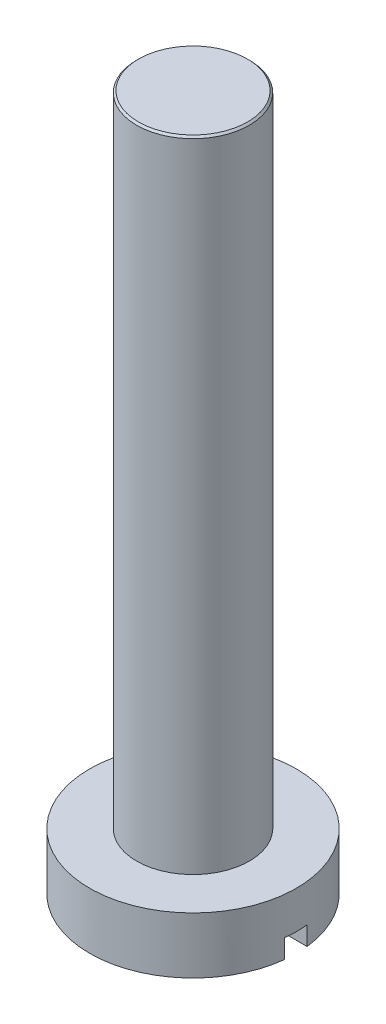
ISO-10303-21;
HEADER;
FILE_DESCRIPTION(('STEP AP214'),'2;1');
FILE_NAME('part.step','',(''),(''),'','','');
FILE_SCHEMA(('AUTOMOTIVE_DESIGN { 1 0 10303 214 1 1 1 1 }'));
ENDSEC;
DATA;
#1=APPLICATION_CONTEXT('core data for automotive mechanical design processes');
#2=APPLICATION_PROTOCOL_DEFINITION('international standard','automotive_design',2000,#1);
#3=PRODUCT_CONTEXT('',#1,'mechanical');
#4=PRODUCT('Part','Part','',(#3));
#5=PRODUCT_RELATED_PRODUCT_CATEGORY('part','',(#4));
#6=PRODUCT_DEFINITION_FORMATION('','',#4);
#7=PRODUCT_DEFINITION_CONTEXT('part definition',#1,'design');
#8=PRODUCT_DEFINITION('design','',#6,#7);
#9=PRODUCT_DEFINITION_SHAPE('','',#8);
#10=(LENGTH_UNIT() NAMED_UNIT(*) SI_UNIT(.MILLI.,.METRE.));
#11=(NAMED_UNIT(*) PLANE_ANGLE_UNIT() SI_UNIT($,.RADIAN.));
#12=(NAMED_UNIT(*) SI_UNIT($,.STERADIAN.) SOLID_ANGLE_UNIT());
#13=UNCERTAINTY_MEASURE_WITH_UNIT(LENGTH_MEASURE(1.E-05),#10,'distance_accuracy_value','');
#14=(GEOMETRIC_REPRESENTATION_CONTEXT(3) GLOBAL_UNCERTAINTY_ASSIGNED_CONTEXT((#13)) GLOBAL_UNIT_ASSIGNED_CONTEXT((#10,
#11,#12)) REPRESENTATION_CONTEXT('',''));
#15=CARTESIAN_POINT('',(0.,0.,0.));
#16=DIRECTION('',(0.,0.,1.));
#17=DIRECTION('',(1.,0.,0.));
#18=AXIS2_PLACEMENT_3D('',#15,#16,#17);
#19=CARTESIAN_POINT('',(0.,-1.5,0.));
#20=DIRECTION('',(0.,-1.,0.));
#21=DIRECTION('',(0.,0.,-1.));
#22=AXIS2_PLACEMENT_3D('',#19,#20,#21);
#23=PLANE('',#22);
#24=DIRECTION('',(1.,0.,0.));
#25=VECTOR('',#24,1.);
#26=CARTESIAN_POINT('',(0.,-1.5,-0.3));
#27=LINE('',#26,#25);
#28=CARTESIAN_POINT('',(-2.73358738656733,-1.5,-0.3));
#29=VERTEX_POINT('',#28);
#30=CARTESIAN_POINT('',(2.73358738656733,-1.5,-0.3));
#31=VERTEX_POINT('',#30);
#32=EDGE_CURVE('E99',#29,#31,#27,.T.);
#33=ORIENTED_EDGE('',*,*,#32,.F.);
#34=CARTESIAN_POINT('',(0.,-1.5,0.));
#35=DIRECTION('',(0.,-1.,0.));
#36=DIRECTION('',(0.,0.,-1.));
#37=AXIS2_PLACEMENT_3D('',#34,#35,#36);
#38=CIRCLE('',#37,2.75);
#39=EDGE_CURVE('E109',#29,#31,#38,.T.);
#40=ORIENTED_EDGE('',*,*,#39,.T.);
#41=EDGE_LOOP('',(#33,#40));
#42=FACE_BOUND('',#41,.T.);
#43=ADVANCED_FACE('F51',(#42),#23,.T.);
#44=CARTESIAN_POINT('',(0.,-1.5,0.));
#45=DIRECTION('',(0.,1.,0.));
#46=DIRECTION('',(0.,0.,1.));
#47=AXIS2_PLACEMENT_3D('',#44,#45,#46);
#48=CYLINDRICAL_SURFACE('',#47,2.75);
#49=CARTESIAN_POINT('',(0.,-1.,0.));
#50=DIRECTION('',(0.,1.,0.));
#51=DIRECTION('',(0.,0.,1.));
#52=AXIS2_PLACEMENT_3D('',#49,#50,#51);
#53=CIRCLE('',#52,2.75);
#54=CARTESIAN_POINT('',(2.73358738656733,-1.,0.3));
#55=VERTEX_POINT('',#54);
#56=CARTESIAN_POINT('',(2.73358738656733,-1.,-0.3));
#57=VERTEX_POINT('',#56);
#58=EDGE_CURVE('E12',#55,#57,#53,.T.);
#59=ORIENTED_EDGE('',*,*,#58,.T.);
#60=DIRECTION('',(0.,1.,0.));
#61=VECTOR('',#60,1.);
#62=CARTESIAN_POINT('',(2.73358738656733,-1.5,-0.3));
#63=LINE('',#62,#61);
#64=EDGE_CURVE('E74',#57,#31,#63,.F.);
#65=ORIENTED_EDGE('',*,*,#64,.T.);
#66=ORIENTED_EDGE('',*,*,#39,.F.);
#67=DIRECTION('',(0.,1.,0.));
#68=VECTOR('',#67,1.);
#69=CARTESIAN_POINT('',(-2.73358738656733,-1.5,-0.3));
#70=LINE('',#69,#68);
#71=CARTESIAN_POINT('',(-2.73358738656733,-1.,-0.3));
#72=VERTEX_POINT('',#71);
#73=EDGE_CURVE('E115',#29,#72,#70,.T.);
#74=ORIENTED_EDGE('',*,*,#73,.T.);
#75=CARTESIAN_POINT('',(-2.73358738656733,-1.,0.3));
#76=VERTEX_POINT('',#75);
#77=EDGE_CURVE('E55',#72,#76,#53,.T.);
#78=ORIENTED_EDGE('',*,*,#77,.T.);
#79=DIRECTION('',(0.,1.,0.));
#80=VECTOR('',#79,1.);
#81=CARTESIAN_POINT('',(-2.73358738656733,-1.5,0.3));
#82=LINE('',#81,#80);
#83=CARTESIAN_POINT('',(-2.73358738656733,-1.5,0.3));
#84=VERTEX_POINT('',#83);
#85=EDGE_CURVE('E94',#76,#84,#82,.F.);
#86=ORIENTED_EDGE('',*,*,#85,.T.);
#87=CARTESIAN_POINT('',(2.73358738656733,-1.5,0.3));
#88=VERTEX_POINT('',#87);
#89=EDGE_CURVE('E100',#88,#84,#38,.T.);
#90=ORIENTED_EDGE('',*,*,#89,.F.);
#91=DIRECTION('',(0.,1.,0.));
#92=VECTOR('',#91,1.);
#93=CARTESIAN_POINT('',(2.73358738656733,-1.5,0.3));
#94=LINE('',#93,#92);
#95=EDGE_CURVE('E66',#88,#55,#94,.T.);
#96=ORIENTED_EDGE('',*,*,#95,.T.);
#97=EDGE_LOOP('',(#59,#65,#66,#74,#78,#86,#90,#96));
#98=FACE_BOUND('',#97,.T.);
#99=CARTESIAN_POINT('',(0.,0.,0.));
#100=DIRECTION('',(0.,-1.,0.));
#101=DIRECTION('',(0.,0.,-1.));
#102=AXIS2_PLACEMENT_3D('',#99,#100,#101);
#103=CIRCLE('',#102,2.75);
#104=CARTESIAN_POINT('',(0.,0.,-2.75));
#105=VERTEX_POINT('',#104);
#106=EDGE_CURVE('E112',#105,#105,#103,.T.);
#107=ORIENTED_EDGE('',*,*,#106,.T.);
#108=EDGE_LOOP('',(#107));
#109=FACE_BOUND('',#108,.T.);
#110=ADVANCED_FACE('F53',(#98,#109),#48,.T.);
#111=DIRECTION('',(-1.,0.,0.));
#112=VECTOR('',#111,1.);
#113=CARTESIAN_POINT('',(0.,-1.5,0.3));
#114=LINE('',#113,#112);
#115=EDGE_CURVE('E91',#88,#84,#114,.T.);
#116=ORIENTED_EDGE('',*,*,#115,.F.);
#117=ORIENTED_EDGE('',*,*,#89,.T.);
#118=EDGE_LOOP('',(#116,#117));
#119=FACE_BOUND('',#118,.T.);
#120=ADVANCED_FACE('F108',(#119),#23,.T.);
#121=CARTESIAN_POINT('',(0.,0.,0.));
#122=DIRECTION('',(0.,-1.,0.));
#123=DIRECTION('',(0.,0.,-1.));
#124=AXIS2_PLACEMENT_3D('',#121,#122,#123);
#125=PLANE('',#124);
#126=ORIENTED_EDGE('',*,*,#106,.F.);
#127=EDGE_LOOP('',(#126));
#128=FACE_BOUND('',#127,.T.);
#129=ADVANCED_FACE('F129',(#128),#125,.F.);
#130=CARTESIAN_POINT('',(0.,-1.,0.));
#131=DIRECTION('',(0.,1.,0.));
#132=DIRECTION('',(0.,0.,1.));
#133=AXIS2_PLACEMENT_3D('',#130,#131,#132);
#134=PLANE('',#133);
#135=DIRECTION('',(-1.,0.,0.));
#136=VECTOR('',#135,1.);
#137=CARTESIAN_POINT('',(-4.09817586391625,-1.,0.3));
#138=LINE('',#137,#136);
#139=EDGE_CURVE('E180',#55,#76,#138,.T.);
#140=ORIENTED_EDGE('',*,*,#139,.T.);
#141=ORIENTED_EDGE('',*,*,#77,.F.);
#142=DIRECTION('',(1.,0.,0.));
#143=VECTOR('',#142,1.);
#144=CARTESIAN_POINT('',(-4.09817586391625,-1.,-0.3));
#145=LINE('',#144,#143);
#146=EDGE_CURVE('E106',#72,#57,#145,.T.);
#147=ORIENTED_EDGE('',*,*,#146,.T.);
#148=ORIENTED_EDGE('',*,*,#58,.F.);
#149=EDGE_LOOP('',(#140,#141,#147,#148));
#150=FACE_BOUND('',#149,.T.);
#151=ADVANCED_FACE('F133',(#150),#134,.F.);
#152=CARTESIAN_POINT('',(-4.09817586391625,-1.,-0.3));
#153=DIRECTION('',(0.,0.,-1.));
#154=DIRECTION('',(-1.,0.,0.));
#155=AXIS2_PLACEMENT_3D('',#152,#153,#154);
#156=PLANE('',#155);
#157=ORIENTED_EDGE('',*,*,#32,.T.);
#158=ORIENTED_EDGE('',*,*,#64,.F.);
#159=ORIENTED_EDGE('',*,*,#146,.F.);
#160=ORIENTED_EDGE('',*,*,#73,.F.);
#161=EDGE_LOOP('',(#157,#158,#159,#160));
#162=FACE_BOUND('',#161,.T.);
#163=ADVANCED_FACE('F119',(#162),#156,.F.);
#164=CARTESIAN_POINT('',(-4.09817586391625,-1.,0.3));
#165=DIRECTION('',(0.,0.,1.));
#166=DIRECTION('',(1.,0.,0.));
#167=AXIS2_PLACEMENT_3D('',#164,#165,#166);
#168=PLANE('',#167);
#169=ORIENTED_EDGE('',*,*,#115,.T.);
#170=ORIENTED_EDGE('',*,*,#85,.F.);
#171=ORIENTED_EDGE('',*,*,#139,.F.);
#172=ORIENTED_EDGE('',*,*,#95,.F.);
#173=EDGE_LOOP('',(#169,#170,#171,#172));
#174=FACE_BOUND('',#173,.T.);
#175=ADVANCED_FACE('F93',(#174),#168,.F.);
#176=CLOSED_SHELL('',(#43,#110,#120,#129,#151,#163,#175));
#177=MANIFOLD_SOLID_BREP('B2',#176);
#178=CARTESIAN_POINT('',(0.,17.,0.));
#179=DIRECTION('',(0.,-1.,0.));
#180=DIRECTION('',(0.,0.,-1.));
#181=AXIS2_PLACEMENT_3D('',#178,#179,#180);
#182=CYLINDRICAL_SURFACE('',#181,1.5);
#183=CARTESIAN_POINT('',(0.,16.95,0.));
#184=DIRECTION('',(0.,1.,0.));
#185=DIRECTION('',(0.,0.,1.));
#186=AXIS2_PLACEMENT_3D('',#183,#184,#185);
#187=CIRCLE('',#186,1.5);
#188=CARTESIAN_POINT('',(0.,16.95,1.5));
#189=VERTEX_POINT('',#188);
#190=EDGE_CURVE('E50',#189,#189,#187,.F.);
#191=ORIENTED_EDGE('',*,*,#190,.T.);
#192=EDGE_LOOP('',(#191));
#193=FACE_BOUND('',#192,.T.);
#194=CARTESIAN_POINT('',(0.,0.,0.));
#195=DIRECTION('',(0.,1.,0.));
#196=DIRECTION('',(0.,0.,1.));
#197=AXIS2_PLACEMENT_3D('',#194,#195,#196);
#198=CIRCLE('',#197,1.5);
#199=CARTESIAN_POINT('',(0.,0.,1.5));
#200=VERTEX_POINT('',#199);
#201=EDGE_CURVE('E200',#200,#200,#198,.T.);
#202=ORIENTED_EDGE('',*,*,#201,.T.);
#203=EDGE_LOOP('',(#202));
#204=FACE_BOUND('',#203,.T.);
#205=ADVANCED_FACE('F187',(#193,#204),#182,.T.);
#206=CARTESIAN_POINT('',(0.,17.,0.));
#207=DIRECTION('',(0.,1.,0.));
#208=DIRECTION('',(0.,0.,1.));
#209=AXIS2_PLACEMENT_3D('',#206,#207,#208);
#210=PLANE('',#209);
#211=CARTESIAN_POINT('',(0.,17.,0.));
#212=DIRECTION('',(0.,1.,0.));
#213=DIRECTION('',(0.,0.,1.));
#214=AXIS2_PLACEMENT_3D('',#211,#212,#213);
#215=CIRCLE('',#214,1.44999999999999);
#216=CARTESIAN_POINT('',(0.,17.,1.44999999999999));
#217=VERTEX_POINT('',#216);
#218=EDGE_CURVE('E195',#217,#217,#215,.T.);
#219=ORIENTED_EDGE('',*,*,#218,.T.);
#220=EDGE_LOOP('',(#219));
#221=FACE_BOUND('',#220,.T.);
#222=ADVANCED_FACE('F211',(#221),#210,.T.);
#223=CARTESIAN_POINT('',(0.,0.,0.));
#224=DIRECTION('',(0.,1.,0.));
#225=DIRECTION('',(0.,0.,1.));
#226=AXIS2_PLACEMENT_3D('',#223,#224,#225);
#227=PLANE('',#226);
#228=ORIENTED_EDGE('',*,*,#201,.F.);
#229=EDGE_LOOP('',(#228));
#230=FACE_BOUND('',#229,.T.);
#231=ADVANCED_FACE('F209',(#230),#227,.F.);
#232=CARTESIAN_POINT('',(0.,17.,0.));
#233=DIRECTION('',(0.,-1.,0.));
#234=DIRECTION('',(0.,0.,-1.));
#235=AXIS2_PLACEMENT_3D('',#232,#233,#234);
#236=CONICAL_SURFACE('',#235,1.44999999999999,0.785398163397422);
#237=ORIENTED_EDGE('',*,*,#190,.F.);
#238=EDGE_LOOP('',(#237));
#239=FACE_BOUND('',#238,.T.);
#240=ORIENTED_EDGE('',*,*,#218,.F.);
#241=EDGE_LOOP('',(#240));
#242=FACE_BOUND('',#241,.T.);
#243=ADVANCED_FACE('F189',(#239,#242),#236,.T.);
#244=CLOSED_SHELL('',(#205,#222,#231,#243));
#245=MANIFOLD_SOLID_BREP('B6',#244);
#246=ADVANCED_BREP_SHAPE_REPRESENTATION('',(#18,#177,#245),#14);
#247=SHAPE_DEFINITION_REPRESENTATION(#9,#246);
ENDSEC;
END-ISO-10303-21;
